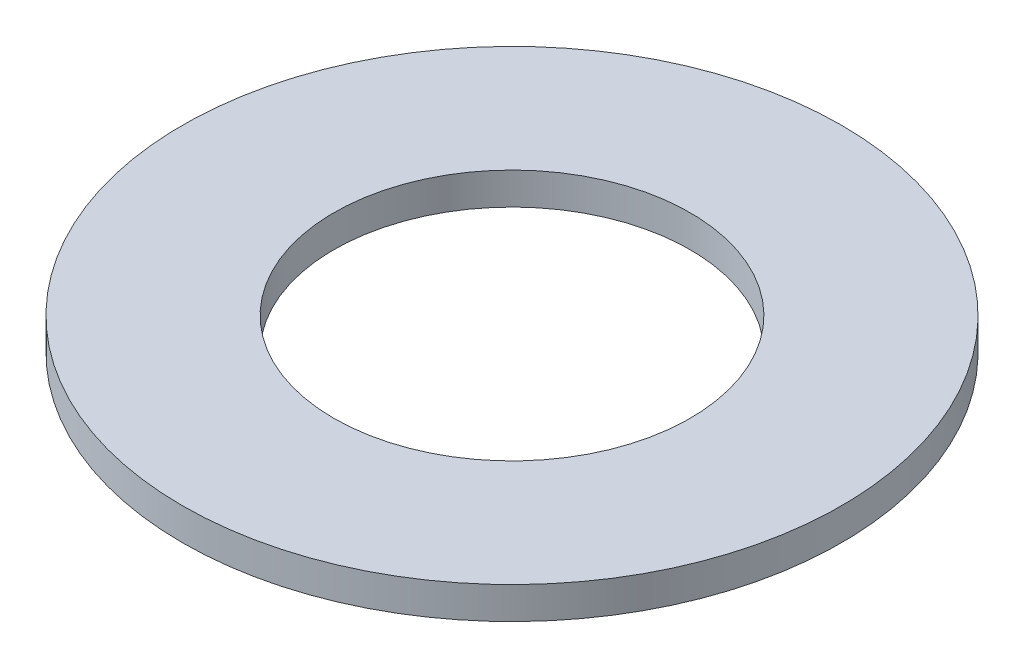
ISO-10303-21;
HEADER;
FILE_DESCRIPTION(('STEP AP214'),'2;1');
FILE_NAME('part.step','',(''),(''),'','','');
FILE_SCHEMA(('AUTOMOTIVE_DESIGN { 1 0 10303 214 1 1 1 1 }'));
ENDSEC;
DATA;
#1=APPLICATION_CONTEXT('core data for automotive mechanical design processes');
#2=APPLICATION_PROTOCOL_DEFINITION('international standard','automotive_design',2000,#1);
#3=PRODUCT_CONTEXT('',#1,'mechanical');
#4=PRODUCT('Part','Part','',(#3));
#5=PRODUCT_RELATED_PRODUCT_CATEGORY('part','',(#4));
#6=PRODUCT_DEFINITION_FORMATION('','',#4);
#7=PRODUCT_DEFINITION_CONTEXT('part definition',#1,'design');
#8=PRODUCT_DEFINITION('design','',#6,#7);
#9=PRODUCT_DEFINITION_SHAPE('','',#8);
#10=(LENGTH_UNIT() NAMED_UNIT(*) SI_UNIT(.MILLI.,.METRE.));
#11=(NAMED_UNIT(*) PLANE_ANGLE_UNIT() SI_UNIT($,.RADIAN.));
#12=(NAMED_UNIT(*) SI_UNIT($,.STERADIAN.) SOLID_ANGLE_UNIT());
#13=UNCERTAINTY_MEASURE_WITH_UNIT(LENGTH_MEASURE(1.E-05),#10,'distance_accuracy_value','');
#14=(GEOMETRIC_REPRESENTATION_CONTEXT(3) GLOBAL_UNCERTAINTY_ASSIGNED_CONTEXT((#13)) GLOBAL_UNIT_ASSIGNED_CONTEXT((#10,
#11,#12)) REPRESENTATION_CONTEXT('',''));
#15=CARTESIAN_POINT('',(0.,0.,0.));
#16=DIRECTION('',(0.,0.,1.));
#17=DIRECTION('',(1.,0.,0.));
#18=AXIS2_PLACEMENT_3D('',#15,#16,#17);
#19=CARTESIAN_POINT('',(0.,9.,0.));
#20=DIRECTION('',(0.,-1.,0.));
#21=DIRECTION('',(0.,0.,-1.));
#22=AXIS2_PLACEMENT_3D('',#19,#20,#21);
#23=CYLINDRICAL_SURFACE('',#22,92.5);
#24=CARTESIAN_POINT('',(0.,9.,0.));
#25=DIRECTION('',(0.,1.,0.));
#26=DIRECTION('',(0.,0.,1.));
#27=AXIS2_PLACEMENT_3D('',#24,#25,#26);
#28=CIRCLE('',#27,92.5);
#29=CARTESIAN_POINT('',(0.,9.,92.5));
#30=VERTEX_POINT('',#29);
#31=EDGE_CURVE('E10',#30,#30,#28,.T.);
#32=ORIENTED_EDGE('',*,*,#31,.F.);
#33=EDGE_LOOP('',(#32));
#34=FACE_BOUND('',#33,.T.);
#35=CARTESIAN_POINT('',(0.,0.,0.));
#36=DIRECTION('',(0.,1.,0.));
#37=DIRECTION('',(0.,0.,1.));
#38=AXIS2_PLACEMENT_3D('',#35,#36,#37);
#39=CIRCLE('',#38,92.5);
#40=CARTESIAN_POINT('',(0.,0.,92.5));
#41=VERTEX_POINT('',#40);
#42=EDGE_CURVE('E37',#41,#41,#39,.T.);
#43=ORIENTED_EDGE('',*,*,#42,.T.);
#44=EDGE_LOOP('',(#43));
#45=FACE_BOUND('',#44,.T.);
#46=ADVANCED_FACE('F40',(#34,#45),#23,.T.);
#47=CARTESIAN_POINT('',(0.,9.,0.));
#48=DIRECTION('',(0.,1.,0.));
#49=DIRECTION('',(0.,0.,1.));
#50=AXIS2_PLACEMENT_3D('',#47,#48,#49);
#51=PLANE('',#50);
#52=CARTESIAN_POINT('',(0.,9.,0.));
#53=DIRECTION('',(0.,1.,0.));
#54=DIRECTION('',(0.,0.,1.));
#55=AXIS2_PLACEMENT_3D('',#52,#53,#54);
#56=CIRCLE('',#55,50.);
#57=CARTESIAN_POINT('',(0.,9.,50.));
#58=VERTEX_POINT('',#57);
#59=EDGE_CURVE('E50',#58,#58,#56,.T.);
#60=ORIENTED_EDGE('',*,*,#59,.F.);
#61=EDGE_LOOP('',(#60));
#62=FACE_BOUND('',#61,.T.);
#63=ORIENTED_EDGE('',*,*,#31,.T.);
#64=EDGE_LOOP('',(#63));
#65=FACE_BOUND('',#64,.T.);
#66=ADVANCED_FACE('F59',(#62,#65),#51,.T.);
#67=CARTESIAN_POINT('',(0.,0.,0.));
#68=DIRECTION('',(0.,1.,0.));
#69=DIRECTION('',(0.,0.,1.));
#70=AXIS2_PLACEMENT_3D('',#67,#68,#69);
#71=PLANE('',#70);
#72=CARTESIAN_POINT('',(0.,0.,0.));
#73=DIRECTION('',(0.,1.,0.));
#74=DIRECTION('',(0.,0.,1.));
#75=AXIS2_PLACEMENT_3D('',#72,#73,#74);
#76=CIRCLE('',#75,50.);
#77=CARTESIAN_POINT('',(0.,0.,50.));
#78=VERTEX_POINT('',#77);
#79=EDGE_CURVE('E47',#78,#78,#76,.T.);
#80=ORIENTED_EDGE('',*,*,#79,.T.);
#81=EDGE_LOOP('',(#80));
#82=FACE_BOUND('',#81,.T.);
#83=ORIENTED_EDGE('',*,*,#42,.F.);
#84=EDGE_LOOP('',(#83));
#85=FACE_BOUND('',#84,.T.);
#86=ADVANCED_FACE('F58',(#82,#85),#71,.F.);
#87=CARTESIAN_POINT('',(0.,9.,0.));
#88=DIRECTION('',(0.,-1.,0.));
#89=DIRECTION('',(0.,0.,-1.));
#90=AXIS2_PLACEMENT_3D('',#87,#88,#89);
#91=CYLINDRICAL_SURFACE('',#90,50.);
#92=ORIENTED_EDGE('',*,*,#59,.T.);
#93=EDGE_LOOP('',(#92));
#94=FACE_BOUND('',#93,.T.);
#95=ORIENTED_EDGE('',*,*,#79,.F.);
#96=EDGE_LOOP('',(#95));
#97=FACE_BOUND('',#96,.T.);
#98=ADVANCED_FACE('F54',(#94,#97),#91,.F.);
#99=CLOSED_SHELL('',(#46,#66,#86,#98));
#100=MANIFOLD_SOLID_BREP('B2',#99);
#101=ADVANCED_BREP_SHAPE_REPRESENTATION('',(#18,#100),#14);
#102=SHAPE_DEFINITION_REPRESENTATION(#9,#101);
ENDSEC;
END-ISO-10303-21;
